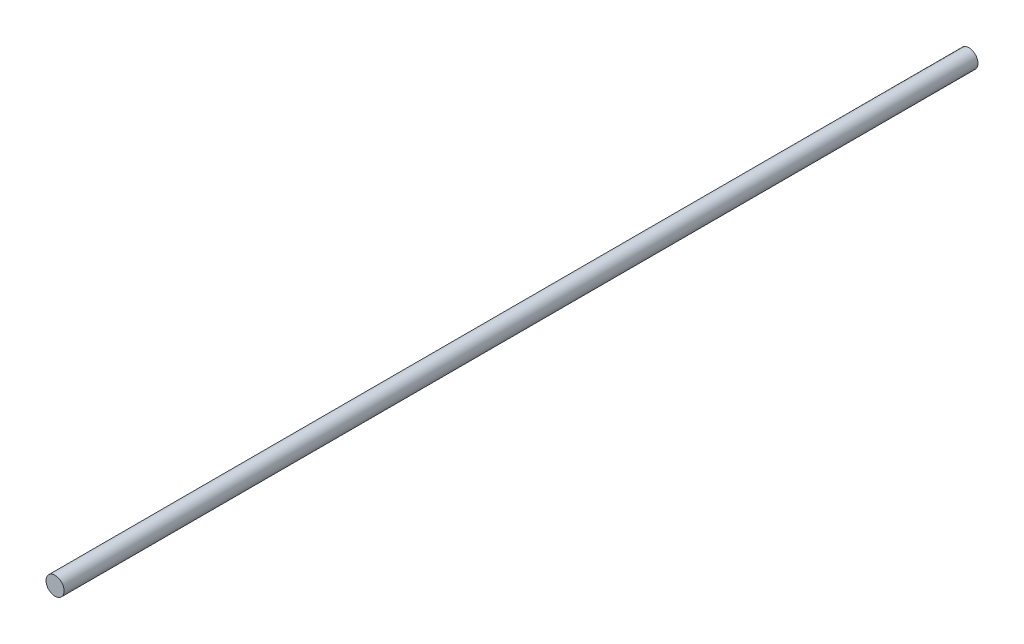
ISO-10303-21;
HEADER;
FILE_DESCRIPTION(('STEP AP214'),'2;1');
FILE_NAME('part.step','',(''),(''),'','','');
FILE_SCHEMA(('AUTOMOTIVE_DESIGN { 1 0 10303 214 1 1 1 1 }'));
ENDSEC;
DATA;
#1=APPLICATION_CONTEXT('core data for automotive mechanical design processes');
#2=APPLICATION_PROTOCOL_DEFINITION('international standard','automotive_design',2000,#1);
#3=PRODUCT_CONTEXT('',#1,'mechanical');
#4=PRODUCT('Part','Part','',(#3));
#5=PRODUCT_RELATED_PRODUCT_CATEGORY('part','',(#4));
#6=PRODUCT_DEFINITION_FORMATION('','',#4);
#7=PRODUCT_DEFINITION_CONTEXT('part definition',#1,'design');
#8=PRODUCT_DEFINITION('design','',#6,#7);
#9=PRODUCT_DEFINITION_SHAPE('','',#8);
#10=(LENGTH_UNIT() NAMED_UNIT(*) SI_UNIT(.MILLI.,.METRE.));
#11=(NAMED_UNIT(*) PLANE_ANGLE_UNIT() SI_UNIT($,.RADIAN.));
#12=(NAMED_UNIT(*) SI_UNIT($,.STERADIAN.) SOLID_ANGLE_UNIT());
#13=UNCERTAINTY_MEASURE_WITH_UNIT(LENGTH_MEASURE(1.E-05),#10,'distance_accuracy_value','');
#14=(GEOMETRIC_REPRESENTATION_CONTEXT(3) GLOBAL_UNCERTAINTY_ASSIGNED_CONTEXT((#13)) GLOBAL_UNIT_ASSIGNED_CONTEXT((#10,
#11,#12)) REPRESENTATION_CONTEXT('',''));
#15=CARTESIAN_POINT('',(0.,0.,0.));
#16=DIRECTION('',(0.,0.,1.));
#17=DIRECTION('',(1.,0.,0.));
#18=AXIS2_PLACEMENT_3D('',#15,#16,#17);
#19=CARTESIAN_POINT('',(0.,0.,-73.));
#20=DIRECTION('',(0.,0.,1.));
#21=DIRECTION('',(1.,0.,0.));
#22=AXIS2_PLACEMENT_3D('',#19,#20,#21);
#23=CYLINDRICAL_SURFACE('',#22,4.);
#24=CARTESIAN_POINT('',(0.,0.,-73.));
#25=DIRECTION('',(0.,0.,1.));
#26=DIRECTION('',(1.,0.,0.));
#27=AXIS2_PLACEMENT_3D('',#24,#25,#26);
#28=CIRCLE('',#27,4.);
#29=CARTESIAN_POINT('',(4.,0.,-73.));
#30=VERTEX_POINT('',#29);
#31=EDGE_CURVE('E10',#30,#30,#28,.T.);
#32=ORIENTED_EDGE('',*,*,#31,.T.);
#33=EDGE_LOOP('',(#32));
#34=FACE_BOUND('',#33,.T.);
#35=CARTESIAN_POINT('',(0.,0.,330.));
#36=DIRECTION('',(0.,0.,1.));
#37=DIRECTION('',(1.,0.,0.));
#38=AXIS2_PLACEMENT_3D('',#35,#36,#37);
#39=CIRCLE('',#38,4.);
#40=CARTESIAN_POINT('',(4.,0.,330.));
#41=VERTEX_POINT('',#40);
#42=EDGE_CURVE('E50',#41,#41,#39,.T.);
#43=ORIENTED_EDGE('',*,*,#42,.F.);
#44=EDGE_LOOP('',(#43));
#45=FACE_BOUND('',#44,.T.);
#46=ADVANCED_FACE('F43',(#34,#45),#23,.T.);
#47=CARTESIAN_POINT('',(0.,0.,-73.));
#48=DIRECTION('',(0.,0.,1.));
#49=DIRECTION('',(1.,0.,0.));
#50=AXIS2_PLACEMENT_3D('',#47,#48,#49);
#51=PLANE('',#50);
#52=ORIENTED_EDGE('',*,*,#31,.F.);
#53=EDGE_LOOP('',(#52));
#54=FACE_BOUND('',#53,.T.);
#55=ADVANCED_FACE('F60',(#54),#51,.F.);
#56=CARTESIAN_POINT('',(0.,0.,330.));
#57=DIRECTION('',(0.,0.,1.));
#58=DIRECTION('',(1.,0.,0.));
#59=AXIS2_PLACEMENT_3D('',#56,#57,#58);
#60=PLANE('',#59);
#61=ORIENTED_EDGE('',*,*,#42,.T.);
#62=EDGE_LOOP('',(#61));
#63=FACE_BOUND('',#62,.T.);
#64=ADVANCED_FACE('F57',(#63),#60,.T.);
#65=CLOSED_SHELL('',(#46,#55,#64));
#66=MANIFOLD_SOLID_BREP('B2',#65);
#67=ADVANCED_BREP_SHAPE_REPRESENTATION('',(#18,#66),#14);
#68=SHAPE_DEFINITION_REPRESENTATION(#9,#67);
ENDSEC;
END-ISO-10303-21;
